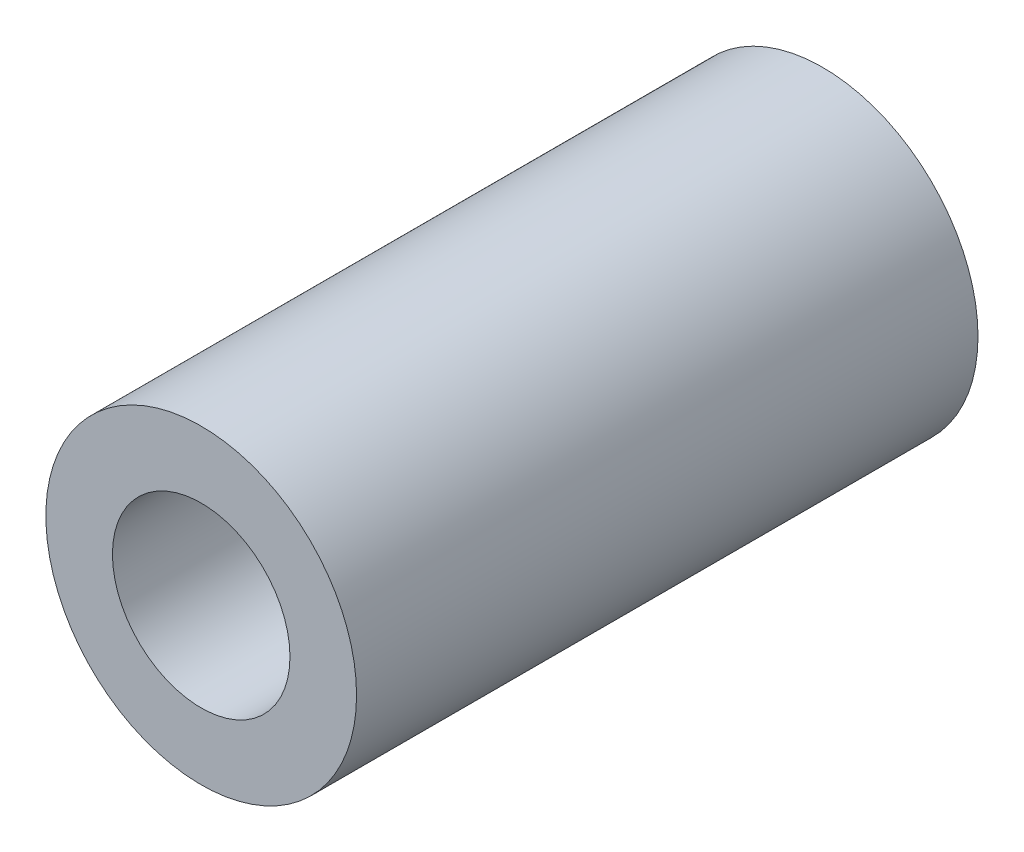
ISO-10303-21;
HEADER;
FILE_DESCRIPTION(('STEP AP214'),'2;1');
FILE_NAME('part.step','',(''),(''),'','','');
FILE_SCHEMA(('AUTOMOTIVE_DESIGN { 1 0 10303 214 1 1 1 1 }'));
ENDSEC;
DATA;
#1=APPLICATION_CONTEXT('core data for automotive mechanical design processes');
#2=APPLICATION_PROTOCOL_DEFINITION('international standard','automotive_design',2000,#1);
#3=PRODUCT_CONTEXT('',#1,'mechanical');
#4=PRODUCT('Part','Part','',(#3));
#5=PRODUCT_RELATED_PRODUCT_CATEGORY('part','',(#4));
#6=PRODUCT_DEFINITION_FORMATION('','',#4);
#7=PRODUCT_DEFINITION_CONTEXT('part definition',#1,'design');
#8=PRODUCT_DEFINITION('design','',#6,#7);
#9=PRODUCT_DEFINITION_SHAPE('','',#8);
#10=(LENGTH_UNIT() NAMED_UNIT(*) SI_UNIT(.MILLI.,.METRE.));
#11=(NAMED_UNIT(*) PLANE_ANGLE_UNIT() SI_UNIT($,.RADIAN.));
#12=(NAMED_UNIT(*) SI_UNIT($,.STERADIAN.) SOLID_ANGLE_UNIT());
#13=UNCERTAINTY_MEASURE_WITH_UNIT(LENGTH_MEASURE(1.E-05),#10,'distance_accuracy_value','');
#14=(GEOMETRIC_REPRESENTATION_CONTEXT(3) GLOBAL_UNCERTAINTY_ASSIGNED_CONTEXT((#13)) GLOBAL_UNIT_ASSIGNED_CONTEXT((#10,
#11,#12)) REPRESENTATION_CONTEXT('',''));
#15=CARTESIAN_POINT('',(0.,0.,0.));
#16=DIRECTION('',(0.,0.,1.));
#17=DIRECTION('',(1.,0.,0.));
#18=AXIS2_PLACEMENT_3D('',#15,#16,#17);
#19=CARTESIAN_POINT('',(0.,0.,-28.));
#20=DIRECTION('',(0.,0.,1.));
#21=DIRECTION('',(1.,0.,0.));
#22=AXIS2_PLACEMENT_3D('',#19,#20,#21);
#23=CYLINDRICAL_SURFACE('',#22,7.);
#24=CARTESIAN_POINT('',(0.,0.,-28.));
#25=DIRECTION('',(0.,0.,1.));
#26=DIRECTION('',(1.,0.,0.));
#27=AXIS2_PLACEMENT_3D('',#24,#25,#26);
#28=CIRCLE('',#27,7.);
#29=CARTESIAN_POINT('',(7.,0.,-28.));
#30=VERTEX_POINT('',#29);
#31=EDGE_CURVE('E10',#30,#30,#28,.T.);
#32=ORIENTED_EDGE('',*,*,#31,.T.);
#33=EDGE_LOOP('',(#32));
#34=FACE_BOUND('',#33,.T.);
#35=CARTESIAN_POINT('',(0.,0.,0.));
#36=DIRECTION('',(0.,0.,1.));
#37=DIRECTION('',(1.,0.,0.));
#38=AXIS2_PLACEMENT_3D('',#35,#36,#37);
#39=CIRCLE('',#38,7.);
#40=CARTESIAN_POINT('',(7.,0.,0.));
#41=VERTEX_POINT('',#40);
#42=EDGE_CURVE('E35',#41,#41,#39,.T.);
#43=ORIENTED_EDGE('',*,*,#42,.F.);
#44=EDGE_LOOP('',(#43));
#45=FACE_BOUND('',#44,.T.);
#46=ADVANCED_FACE('F32',(#34,#45),#23,.T.);
#47=CARTESIAN_POINT('',(0.,0.,-28.));
#48=DIRECTION('',(0.,0.,1.));
#49=DIRECTION('',(1.,0.,0.));
#50=AXIS2_PLACEMENT_3D('',#47,#48,#49);
#51=PLANE('',#50);
#52=CARTESIAN_POINT('',(0.,0.,-28.));
#53=DIRECTION('',(0.,0.,1.));
#54=DIRECTION('',(1.,0.,0.));
#55=AXIS2_PLACEMENT_3D('',#52,#53,#54);
#56=CIRCLE('',#55,4.);
#57=CARTESIAN_POINT('',(4.,0.,-28.));
#58=VERTEX_POINT('',#57);
#59=EDGE_CURVE('E42',#58,#58,#56,.T.);
#60=ORIENTED_EDGE('',*,*,#59,.T.);
#61=EDGE_LOOP('',(#60));
#62=FACE_BOUND('',#61,.T.);
#63=ORIENTED_EDGE('',*,*,#31,.F.);
#64=EDGE_LOOP('',(#63));
#65=FACE_BOUND('',#64,.T.);
#66=ADVANCED_FACE('F50',(#62,#65),#51,.F.);
#67=CARTESIAN_POINT('',(0.,0.,0.));
#68=DIRECTION('',(0.,0.,1.));
#69=DIRECTION('',(1.,0.,0.));
#70=AXIS2_PLACEMENT_3D('',#67,#68,#69);
#71=PLANE('',#70);
#72=CARTESIAN_POINT('',(0.,0.,0.));
#73=DIRECTION('',(0.,0.,1.));
#74=DIRECTION('',(1.,0.,0.));
#75=AXIS2_PLACEMENT_3D('',#72,#73,#74);
#76=CIRCLE('',#75,4.);
#77=CARTESIAN_POINT('',(4.,0.,0.));
#78=VERTEX_POINT('',#77);
#79=EDGE_CURVE('E44',#78,#78,#76,.T.);
#80=ORIENTED_EDGE('',*,*,#79,.F.);
#81=EDGE_LOOP('',(#80));
#82=FACE_BOUND('',#81,.T.);
#83=ORIENTED_EDGE('',*,*,#42,.T.);
#84=EDGE_LOOP('',(#83));
#85=FACE_BOUND('',#84,.T.);
#86=ADVANCED_FACE('F56',(#82,#85),#71,.T.);
#87=CARTESIAN_POINT('',(0.,0.,-28.));
#88=DIRECTION('',(0.,0.,1.));
#89=DIRECTION('',(1.,0.,0.));
#90=AXIS2_PLACEMENT_3D('',#87,#88,#89);
#91=CYLINDRICAL_SURFACE('',#90,4.);
#92=ORIENTED_EDGE('',*,*,#59,.F.);
#93=EDGE_LOOP('',(#92));
#94=FACE_BOUND('',#93,.T.);
#95=ORIENTED_EDGE('',*,*,#79,.T.);
#96=EDGE_LOOP('',(#95));
#97=FACE_BOUND('',#96,.T.);
#98=ADVANCED_FACE('F53',(#94,#97),#91,.F.);
#99=CLOSED_SHELL('',(#46,#66,#86,#98));
#100=MANIFOLD_SOLID_BREP('B2',#99);
#101=ADVANCED_BREP_SHAPE_REPRESENTATION('',(#18,#100),#14);
#102=SHAPE_DEFINITION_REPRESENTATION(#9,#101);
ENDSEC;
END-ISO-10303-21;
